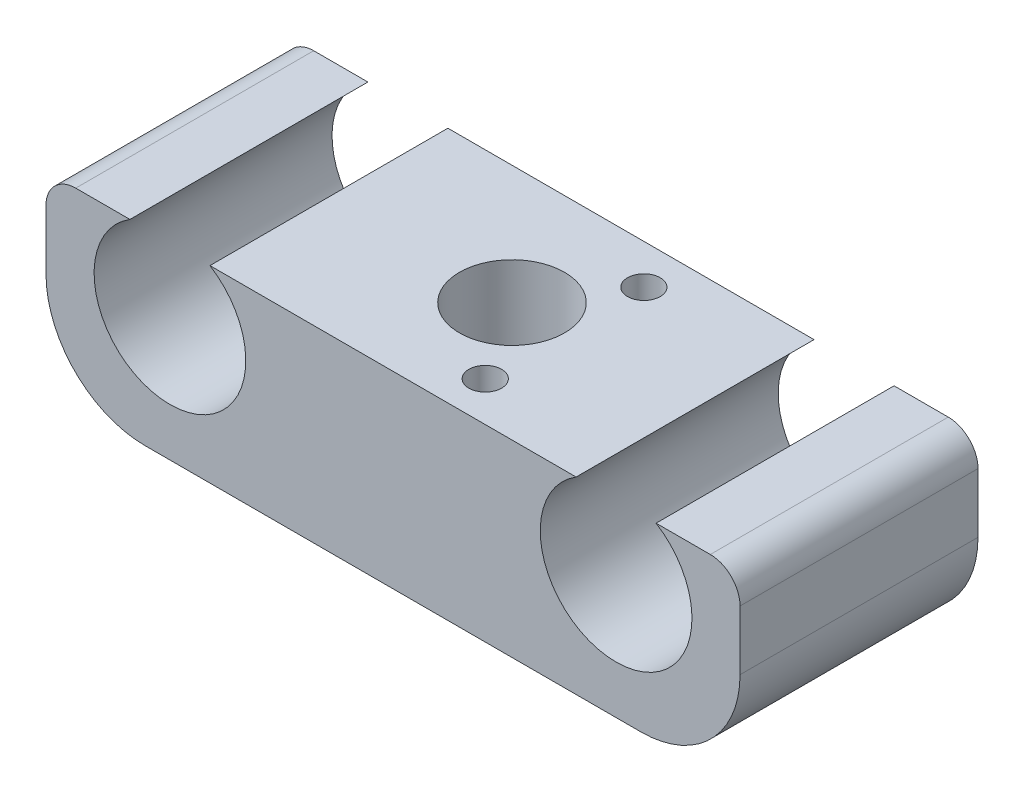
ISO-10303-21;
HEADER;
FILE_DESCRIPTION(('STEP AP214'),'2;1');
FILE_NAME('part.step','',(''),(''),'','','');
FILE_SCHEMA(('AUTOMOTIVE_DESIGN { 1 0 10303 214 1 1 1 1 }'));
ENDSEC;
DATA;
#1=APPLICATION_CONTEXT('core data for automotive mechanical design processes');
#2=APPLICATION_PROTOCOL_DEFINITION('international standard','automotive_design',2000,#1);
#3=PRODUCT_CONTEXT('',#1,'mechanical');
#4=PRODUCT('Part','Part','',(#3));
#5=PRODUCT_RELATED_PRODUCT_CATEGORY('part','',(#4));
#6=PRODUCT_DEFINITION_FORMATION('','',#4);
#7=PRODUCT_DEFINITION_CONTEXT('part definition',#1,'design');
#8=PRODUCT_DEFINITION('design','',#6,#7);
#9=PRODUCT_DEFINITION_SHAPE('','',#8);
#10=(LENGTH_UNIT() NAMED_UNIT(*) SI_UNIT(.MILLI.,.METRE.));
#11=(NAMED_UNIT(*) PLANE_ANGLE_UNIT() SI_UNIT($,.RADIAN.));
#12=(NAMED_UNIT(*) SI_UNIT($,.STERADIAN.) SOLID_ANGLE_UNIT());
#13=UNCERTAINTY_MEASURE_WITH_UNIT(LENGTH_MEASURE(1.E-05),#10,'distance_accuracy_value','');
#14=(GEOMETRIC_REPRESENTATION_CONTEXT(3) GLOBAL_UNCERTAINTY_ASSIGNED_CONTEXT((#13)) GLOBAL_UNIT_ASSIGNED_CONTEXT((#10,
#11,#12)) REPRESENTATION_CONTEXT('',''));
#15=CARTESIAN_POINT('',(0.,0.,0.));
#16=DIRECTION('',(0.,0.,1.));
#17=DIRECTION('',(1.,0.,0.));
#18=AXIS2_PLACEMENT_3D('',#15,#16,#17);
#19=CARTESIAN_POINT('',(0.,19.,24.));
#20=DIRECTION('',(0.,-1.,0.));
#21=DIRECTION('',(0.,0.,-1.));
#22=AXIS2_PLACEMENT_3D('',#19,#20,#21);
#23=PLANE('',#22);
#24=CARTESIAN_POINT('',(40.3,19.,4.));
#25=DIRECTION('',(0.,1.,0.));
#26=DIRECTION('',(0.,0.,1.));
#27=AXIS2_PLACEMENT_3D('',#24,#25,#26);
#28=CIRCLE('',#27,1.65);
#29=CARTESIAN_POINT('',(40.3,19.,5.65));
#30=VERTEX_POINT('',#29);
#31=EDGE_CURVE('E220',#30,#30,#28,.T.);
#32=ORIENTED_EDGE('',*,*,#31,.F.);
#33=EDGE_LOOP('',(#32));
#34=FACE_BOUND('',#33,.T.);
#35=CARTESIAN_POINT('',(40.3,19.,20.));
#36=DIRECTION('',(0.,1.,0.));
#37=DIRECTION('',(0.,0.,1.));
#38=AXIS2_PLACEMENT_3D('',#35,#36,#37);
#39=CIRCLE('',#38,1.65);
#40=CARTESIAN_POINT('',(40.3,19.,21.65));
#41=VERTEX_POINT('',#40);
#42=EDGE_CURVE('E209',#41,#41,#39,.T.);
#43=ORIENTED_EDGE('',*,*,#42,.F.);
#44=EDGE_LOOP('',(#43));
#45=FACE_BOUND('',#44,.T.);
#46=CARTESIAN_POINT('',(35.,19.,12.));
#47=DIRECTION('',(0.,-1.,0.));
#48=DIRECTION('',(0.,0.,-1.));
#49=AXIS2_PLACEMENT_3D('',#46,#47,#48);
#50=CIRCLE('',#49,5.3);
#51=CARTESIAN_POINT('',(35.,19.,6.7));
#52=VERTEX_POINT('',#51);
#53=EDGE_CURVE('E213',#52,#52,#50,.T.);
#54=ORIENTED_EDGE('',*,*,#53,.T.);
#55=EDGE_LOOP('',(#54));
#56=FACE_BOUND('',#55,.T.);
#57=DIRECTION('',(-1.,0.,0.));
#58=VECTOR('',#57,1.);
#59=CARTESIAN_POINT('',(0.,19.,0.));
#60=LINE('',#59,#58);
#61=CARTESIAN_POINT('',(53.466081309694,19.,0.));
#62=VERTEX_POINT('',#61);
#63=CARTESIAN_POINT('',(16.533918690306,19.,0.));
#64=VERTEX_POINT('',#63);
#65=EDGE_CURVE('E150',#62,#64,#60,.T.);
#66=ORIENTED_EDGE('',*,*,#65,.T.);
#67=DIRECTION('',(0.,0.,1.));
#68=VECTOR('',#67,1.);
#69=CARTESIAN_POINT('',(16.533918690306,19.,0.));
#70=LINE('',#69,#68);
#71=CARTESIAN_POINT('',(16.533918690306,19.,24.));
#72=VERTEX_POINT('',#71);
#73=EDGE_CURVE('E130',#64,#72,#70,.T.);
#74=ORIENTED_EDGE('',*,*,#73,.T.);
#75=DIRECTION('',(-1.,0.,0.));
#76=VECTOR('',#75,1.);
#77=CARTESIAN_POINT('',(0.,19.,24.));
#78=LINE('',#77,#76);
#79=CARTESIAN_POINT('',(53.466081309694,19.,24.));
#80=VERTEX_POINT('',#79);
#81=EDGE_CURVE('E177',#80,#72,#78,.T.);
#82=ORIENTED_EDGE('',*,*,#81,.F.);
#83=DIRECTION('',(0.,0.,1.));
#84=VECTOR('',#83,1.);
#85=CARTESIAN_POINT('',(53.466081309694,19.,0.));
#86=LINE('',#85,#84);
#87=EDGE_CURVE('E229',#80,#62,#86,.F.);
#88=ORIENTED_EDGE('',*,*,#87,.T.);
#89=EDGE_LOOP('',(#66,#74,#82,#88));
#90=FACE_BOUND('',#89,.T.);
#91=ADVANCED_FACE('F34',(#34,#45,#56,#90),#23,.F.);
#92=CARTESIAN_POINT('',(67.,19.,24.));
#93=VERTEX_POINT('',#92);
#94=CARTESIAN_POINT('',(61.533918690306,19.,24.));
#95=VERTEX_POINT('',#94);
#96=EDGE_CURVE('E175',#93,#95,#78,.T.);
#97=ORIENTED_EDGE('',*,*,#96,.F.);
#98=DIRECTION('',(0.,0.,-1.));
#99=VECTOR('',#98,1.);
#100=CARTESIAN_POINT('',(67.,19.,24.));
#101=LINE('',#100,#99);
#102=CARTESIAN_POINT('',(67.,19.,0.));
#103=VERTEX_POINT('',#102);
#104=EDGE_CURVE('E198',#93,#103,#101,.T.);
#105=ORIENTED_EDGE('',*,*,#104,.T.);
#106=CARTESIAN_POINT('',(61.533918690306,19.,0.));
#107=VERTEX_POINT('',#106);
#108=EDGE_CURVE('E153',#103,#107,#60,.T.);
#109=ORIENTED_EDGE('',*,*,#108,.T.);
#110=DIRECTION('',(0.,0.,1.));
#111=VECTOR('',#110,1.);
#112=CARTESIAN_POINT('',(61.533918690306,19.,0.));
#113=LINE('',#112,#111);
#114=EDGE_CURVE('E171',#107,#95,#113,.T.);
#115=ORIENTED_EDGE('',*,*,#114,.T.);
#116=EDGE_LOOP('',(#97,#105,#109,#115));
#117=FACE_BOUND('',#116,.T.);
#118=ADVANCED_FACE('F234',(#117),#23,.F.);
#119=CARTESIAN_POINT('',(0.,0.,24.));
#120=DIRECTION('',(1.,0.,0.));
#121=DIRECTION('',(0.,0.,-1.));
#122=AXIS2_PLACEMENT_3D('',#119,#120,#121);
#123=PLANE('',#122);
#124=DIRECTION('',(0.,-1.,0.));
#125=VECTOR('',#124,1.);
#126=CARTESIAN_POINT('',(0.,0.,24.));
#127=LINE('',#126,#125);
#128=CARTESIAN_POINT('',(0.,16.,24.));
#129=VERTEX_POINT('',#128);
#130=CARTESIAN_POINT('',(0.,10.,24.));
#131=VERTEX_POINT('',#130);
#132=EDGE_CURVE('E157',#129,#131,#127,.T.);
#133=ORIENTED_EDGE('',*,*,#132,.F.);
#134=DIRECTION('',(0.,0.,-1.));
#135=VECTOR('',#134,1.);
#136=CARTESIAN_POINT('',(0.,16.,24.));
#137=LINE('',#136,#135);
#138=CARTESIAN_POINT('',(0.,16.,0.));
#139=VERTEX_POINT('',#138);
#140=EDGE_CURVE('E248',#129,#139,#137,.T.);
#141=ORIENTED_EDGE('',*,*,#140,.T.);
#142=DIRECTION('',(0.,-1.,0.));
#143=VECTOR('',#142,1.);
#144=CARTESIAN_POINT('',(0.,0.,0.));
#145=LINE('',#144,#143);
#146=CARTESIAN_POINT('',(0.,10.,0.));
#147=VERTEX_POINT('',#146);
#148=EDGE_CURVE('E178',#139,#147,#145,.T.);
#149=ORIENTED_EDGE('',*,*,#148,.T.);
#150=DIRECTION('',(0.,0.,-1.));
#151=VECTOR('',#150,1.);
#152=CARTESIAN_POINT('',(0.,10.,24.));
#153=LINE('',#152,#151);
#154=EDGE_CURVE('E244',#147,#131,#153,.F.);
#155=ORIENTED_EDGE('',*,*,#154,.T.);
#156=EDGE_LOOP('',(#133,#141,#149,#155));
#157=FACE_BOUND('',#156,.T.);
#158=ADVANCED_FACE('F274',(#157),#123,.F.);
#159=CARTESIAN_POINT('',(0.,0.,24.));
#160=DIRECTION('',(0.,1.,0.));
#161=DIRECTION('',(0.,0.,1.));
#162=AXIS2_PLACEMENT_3D('',#159,#160,#161);
#163=PLANE('',#162);
#164=CARTESIAN_POINT('',(40.3,0.,4.));
#165=DIRECTION('',(0.,1.,0.));
#166=DIRECTION('',(0.,0.,1.));
#167=AXIS2_PLACEMENT_3D('',#164,#165,#166);
#168=CIRCLE('',#167,1.65);
#169=CARTESIAN_POINT('',(40.3,0.,5.65));
#170=VERTEX_POINT('',#169);
#171=EDGE_CURVE('E38',#170,#170,#168,.T.);
#172=ORIENTED_EDGE('',*,*,#171,.T.);
#173=EDGE_LOOP('',(#172));
#174=FACE_BOUND('',#173,.T.);
#175=CARTESIAN_POINT('',(40.3,0.,20.));
#176=DIRECTION('',(0.,1.,0.));
#177=DIRECTION('',(0.,0.,1.));
#178=AXIS2_PLACEMENT_3D('',#175,#176,#177);
#179=CIRCLE('',#178,1.65);
#180=CARTESIAN_POINT('',(40.3,0.,21.65));
#181=VERTEX_POINT('',#180);
#182=EDGE_CURVE('E206',#181,#181,#179,.T.);
#183=ORIENTED_EDGE('',*,*,#182,.T.);
#184=EDGE_LOOP('',(#183));
#185=FACE_BOUND('',#184,.T.);
#186=CARTESIAN_POINT('',(35.,0.,12.));
#187=DIRECTION('',(0.,-1.,0.));
#188=DIRECTION('',(0.,0.,-1.));
#189=AXIS2_PLACEMENT_3D('',#186,#187,#188);
#190=CIRCLE('',#189,5.3);
#191=CARTESIAN_POINT('',(35.,0.,6.7));
#192=VERTEX_POINT('',#191);
#193=EDGE_CURVE('E208',#192,#192,#190,.T.);
#194=ORIENTED_EDGE('',*,*,#193,.F.);
#195=EDGE_LOOP('',(#194));
#196=FACE_BOUND('',#195,.T.);
#197=DIRECTION('',(1.,0.,0.));
#198=VECTOR('',#197,1.);
#199=CARTESIAN_POINT('',(0.,0.,0.));
#200=LINE('',#199,#198);
#201=CARTESIAN_POINT('',(10.,0.,0.));
#202=VERTEX_POINT('',#201);
#203=CARTESIAN_POINT('',(60.,0.,0.));
#204=VERTEX_POINT('',#203);
#205=EDGE_CURVE('E154',#202,#204,#200,.T.);
#206=ORIENTED_EDGE('',*,*,#205,.T.);
#207=DIRECTION('',(0.,0.,-1.));
#208=VECTOR('',#207,1.);
#209=CARTESIAN_POINT('',(60.,0.,24.));
#210=LINE('',#209,#208);
#211=CARTESIAN_POINT('',(60.,0.,24.));
#212=VERTEX_POINT('',#211);
#213=EDGE_CURVE('E187',#204,#212,#210,.F.);
#214=ORIENTED_EDGE('',*,*,#213,.T.);
#215=DIRECTION('',(1.,0.,0.));
#216=VECTOR('',#215,1.);
#217=CARTESIAN_POINT('',(0.,0.,24.));
#218=LINE('',#217,#216);
#219=CARTESIAN_POINT('',(10.,0.,24.));
#220=VERTEX_POINT('',#219);
#221=EDGE_CURVE('E162',#220,#212,#218,.T.);
#222=ORIENTED_EDGE('',*,*,#221,.F.);
#223=DIRECTION('',(0.,0.,-1.));
#224=VECTOR('',#223,1.);
#225=CARTESIAN_POINT('',(10.,0.,24.));
#226=LINE('',#225,#224);
#227=EDGE_CURVE('E134',#220,#202,#226,.T.);
#228=ORIENTED_EDGE('',*,*,#227,.T.);
#229=EDGE_LOOP('',(#206,#214,#222,#228));
#230=FACE_BOUND('',#229,.T.);
#231=ADVANCED_FACE('F185',(#174,#185,#196,#230),#163,.F.);
#232=CARTESIAN_POINT('',(70.,19.,24.));
#233=DIRECTION('',(-1.,0.,0.));
#234=DIRECTION('',(0.,0.,1.));
#235=AXIS2_PLACEMENT_3D('',#232,#233,#234);
#236=PLANE('',#235);
#237=DIRECTION('',(0.,1.,0.));
#238=VECTOR('',#237,1.);
#239=CARTESIAN_POINT('',(70.,19.,0.));
#240=LINE('',#239,#238);
#241=CARTESIAN_POINT('',(70.,10.,0.));
#242=VERTEX_POINT('',#241);
#243=CARTESIAN_POINT('',(70.,16.,0.));
#244=VERTEX_POINT('',#243);
#245=EDGE_CURVE('E151',#242,#244,#240,.T.);
#246=ORIENTED_EDGE('',*,*,#245,.T.);
#247=DIRECTION('',(0.,0.,-1.));
#248=VECTOR('',#247,1.);
#249=CARTESIAN_POINT('',(70.,16.,24.));
#250=LINE('',#249,#248);
#251=CARTESIAN_POINT('',(70.,16.,24.));
#252=VERTEX_POINT('',#251);
#253=EDGE_CURVE('E43',#244,#252,#250,.F.);
#254=ORIENTED_EDGE('',*,*,#253,.T.);
#255=DIRECTION('',(0.,1.,0.));
#256=VECTOR('',#255,1.);
#257=CARTESIAN_POINT('',(70.,19.,24.));
#258=LINE('',#257,#256);
#259=CARTESIAN_POINT('',(70.,10.,24.));
#260=VERTEX_POINT('',#259);
#261=EDGE_CURVE('E168',#260,#252,#258,.T.);
#262=ORIENTED_EDGE('',*,*,#261,.F.);
#263=DIRECTION('',(0.,0.,-1.));
#264=VECTOR('',#263,1.);
#265=CARTESIAN_POINT('',(70.,10.,24.));
#266=LINE('',#265,#264);
#267=EDGE_CURVE('E200',#260,#242,#266,.T.);
#268=ORIENTED_EDGE('',*,*,#267,.T.);
#269=EDGE_LOOP('',(#246,#254,#262,#268));
#270=FACE_BOUND('',#269,.T.);
#271=ADVANCED_FACE('F255',(#270),#236,.F.);
#272=CARTESIAN_POINT('',(8.46608130969402,19.,0.));
#273=VERTEX_POINT('',#272);
#274=CARTESIAN_POINT('',(3.,19.,0.));
#275=VERTEX_POINT('',#274);
#276=EDGE_CURVE('E141',#273,#275,#60,.T.);
#277=ORIENTED_EDGE('',*,*,#276,.T.);
#278=DIRECTION('',(0.,0.,-1.));
#279=VECTOR('',#278,1.);
#280=CARTESIAN_POINT('',(3.,19.,24.));
#281=LINE('',#280,#279);
#282=CARTESIAN_POINT('',(3.,19.,24.));
#283=VERTEX_POINT('',#282);
#284=EDGE_CURVE('E252',#275,#283,#281,.F.);
#285=ORIENTED_EDGE('',*,*,#284,.T.);
#286=CARTESIAN_POINT('',(8.46608130969402,19.,24.));
#287=VERTEX_POINT('',#286);
#288=EDGE_CURVE('E144',#287,#283,#78,.T.);
#289=ORIENTED_EDGE('',*,*,#288,.F.);
#290=DIRECTION('',(0.,0.,1.));
#291=VECTOR('',#290,1.);
#292=CARTESIAN_POINT('',(8.46608130969402,19.,0.));
#293=LINE('',#292,#291);
#294=EDGE_CURVE('E127',#287,#273,#293,.F.);
#295=ORIENTED_EDGE('',*,*,#294,.T.);
#296=EDGE_LOOP('',(#277,#285,#289,#295));
#297=FACE_BOUND('',#296,.T.);
#298=ADVANCED_FACE('F140',(#297),#23,.F.);
#299=CARTESIAN_POINT('',(0.,0.,24.));
#300=DIRECTION('',(0.,0.,-1.));
#301=DIRECTION('',(-1.,0.,0.));
#302=AXIS2_PLACEMENT_3D('',#299,#300,#301);
#303=PLANE('',#302);
#304=ORIENTED_EDGE('',*,*,#261,.T.);
#305=CARTESIAN_POINT('',(67.,16.,24.));
#306=DIRECTION('',(0.,0.,-1.));
#307=DIRECTION('',(-1.,0.,0.));
#308=AXIS2_PLACEMENT_3D('',#305,#306,#307);
#309=CIRCLE('',#308,3.);
#310=EDGE_CURVE('E11',#252,#93,#309,.F.);
#311=ORIENTED_EDGE('',*,*,#310,.T.);
#312=ORIENTED_EDGE('',*,*,#96,.T.);
#313=CARTESIAN_POINT('',(57.5,12.5,24.));
#314=DIRECTION('',(0.,0.,1.));
#315=DIRECTION('',(1.,0.,0.));
#316=AXIS2_PLACEMENT_3D('',#313,#314,#315);
#317=CIRCLE('',#316,7.65);
#318=EDGE_CURVE('E227',#80,#95,#317,.T.);
#319=ORIENTED_EDGE('',*,*,#318,.F.);
#320=ORIENTED_EDGE('',*,*,#81,.T.);
#321=CARTESIAN_POINT('',(12.5,12.5,24.));
#322=DIRECTION('',(0.,0.,1.));
#323=DIRECTION('',(1.,0.,0.));
#324=AXIS2_PLACEMENT_3D('',#321,#322,#323);
#325=CIRCLE('',#324,7.65);
#326=EDGE_CURVE('E145',#287,#72,#325,.T.);
#327=ORIENTED_EDGE('',*,*,#326,.F.);
#328=ORIENTED_EDGE('',*,*,#288,.T.);
#329=CARTESIAN_POINT('',(3.,16.,24.));
#330=DIRECTION('',(0.,0.,-1.));
#331=DIRECTION('',(-1.,0.,0.));
#332=AXIS2_PLACEMENT_3D('',#329,#330,#331);
#333=CIRCLE('',#332,3.);
#334=EDGE_CURVE('E254',#283,#129,#333,.F.);
#335=ORIENTED_EDGE('',*,*,#334,.T.);
#336=ORIENTED_EDGE('',*,*,#132,.T.);
#337=CARTESIAN_POINT('',(10.,10.,24.));
#338=DIRECTION('',(0.,0.,-1.));
#339=DIRECTION('',(-1.,0.,0.));
#340=AXIS2_PLACEMENT_3D('',#337,#338,#339);
#341=CIRCLE('',#340,10.);
#342=EDGE_CURVE('E246',#131,#220,#341,.F.);
#343=ORIENTED_EDGE('',*,*,#342,.T.);
#344=ORIENTED_EDGE('',*,*,#221,.T.);
#345=CARTESIAN_POINT('',(60.,10.,24.));
#346=DIRECTION('',(0.,0.,-1.));
#347=DIRECTION('',(-1.,0.,0.));
#348=AXIS2_PLACEMENT_3D('',#345,#346,#347);
#349=CIRCLE('',#348,10.);
#350=EDGE_CURVE('E196',#212,#260,#349,.F.);
#351=ORIENTED_EDGE('',*,*,#350,.T.);
#352=EDGE_LOOP('',(#304,#311,#312,#319,#320,#327,#328,#335,#336,#343,#344,#351));
#353=FACE_BOUND('',#352,.T.);
#354=ADVANCED_FACE('F257',(#353),#303,.F.);
#355=CARTESIAN_POINT('',(0.,0.,0.));
#356=DIRECTION('',(0.,0.,-1.));
#357=DIRECTION('',(-1.,0.,0.));
#358=AXIS2_PLACEMENT_3D('',#355,#356,#357);
#359=PLANE('',#358);
#360=ORIENTED_EDGE('',*,*,#108,.F.);
#361=CARTESIAN_POINT('',(67.,16.,0.));
#362=DIRECTION('',(0.,0.,-1.));
#363=DIRECTION('',(-1.,0.,0.));
#364=AXIS2_PLACEMENT_3D('',#361,#362,#363);
#365=CIRCLE('',#364,3.);
#366=EDGE_CURVE('E58',#103,#244,#365,.T.);
#367=ORIENTED_EDGE('',*,*,#366,.T.);
#368=ORIENTED_EDGE('',*,*,#245,.F.);
#369=CARTESIAN_POINT('',(60.,10.,0.));
#370=DIRECTION('',(0.,0.,-1.));
#371=DIRECTION('',(-1.,0.,0.));
#372=AXIS2_PLACEMENT_3D('',#369,#370,#371);
#373=CIRCLE('',#372,10.);
#374=EDGE_CURVE('E194',#242,#204,#373,.T.);
#375=ORIENTED_EDGE('',*,*,#374,.T.);
#376=ORIENTED_EDGE('',*,*,#205,.F.);
#377=CARTESIAN_POINT('',(10.,10.,0.));
#378=DIRECTION('',(0.,0.,-1.));
#379=DIRECTION('',(-1.,0.,0.));
#380=AXIS2_PLACEMENT_3D('',#377,#378,#379);
#381=CIRCLE('',#380,10.);
#382=EDGE_CURVE('E242',#202,#147,#381,.T.);
#383=ORIENTED_EDGE('',*,*,#382,.T.);
#384=ORIENTED_EDGE('',*,*,#148,.F.);
#385=CARTESIAN_POINT('',(3.,16.,0.));
#386=DIRECTION('',(0.,0.,-1.));
#387=DIRECTION('',(-1.,0.,0.));
#388=AXIS2_PLACEMENT_3D('',#385,#386,#387);
#389=CIRCLE('',#388,3.);
#390=EDGE_CURVE('E149',#139,#275,#389,.T.);
#391=ORIENTED_EDGE('',*,*,#390,.T.);
#392=ORIENTED_EDGE('',*,*,#276,.F.);
#393=CARTESIAN_POINT('',(12.5,12.5,0.));
#394=DIRECTION('',(0.,0.,-1.));
#395=DIRECTION('',(-1.,0.,0.));
#396=AXIS2_PLACEMENT_3D('',#393,#394,#395);
#397=CIRCLE('',#396,7.65);
#398=EDGE_CURVE('E124',#64,#273,#397,.T.);
#399=ORIENTED_EDGE('',*,*,#398,.F.);
#400=ORIENTED_EDGE('',*,*,#65,.F.);
#401=CARTESIAN_POINT('',(57.5,12.5,0.));
#402=DIRECTION('',(0.,0.,-1.));
#403=DIRECTION('',(-1.,0.,0.));
#404=AXIS2_PLACEMENT_3D('',#401,#402,#403);
#405=CIRCLE('',#404,7.65);
#406=EDGE_CURVE('E135',#107,#62,#405,.T.);
#407=ORIENTED_EDGE('',*,*,#406,.F.);
#408=EDGE_LOOP('',(#360,#367,#368,#375,#376,#383,#384,#391,#392,#399,#400,#407));
#409=FACE_BOUND('',#408,.T.);
#410=ADVANCED_FACE('F147',(#409),#359,.T.);
#411=CARTESIAN_POINT('',(57.5,12.5,0.));
#412=DIRECTION('',(0.,0.,1.));
#413=DIRECTION('',(1.,0.,0.));
#414=AXIS2_PLACEMENT_3D('',#411,#412,#413);
#415=CYLINDRICAL_SURFACE('',#414,7.65);
#416=ORIENTED_EDGE('',*,*,#406,.T.);
#417=ORIENTED_EDGE('',*,*,#87,.F.);
#418=ORIENTED_EDGE('',*,*,#318,.T.);
#419=ORIENTED_EDGE('',*,*,#114,.F.);
#420=EDGE_LOOP('',(#416,#417,#418,#419));
#421=FACE_BOUND('',#420,.T.);
#422=ADVANCED_FACE('F238',(#421),#415,.F.);
#423=CARTESIAN_POINT('',(12.5,12.5,0.));
#424=DIRECTION('',(0.,0.,1.));
#425=DIRECTION('',(1.,0.,0.));
#426=AXIS2_PLACEMENT_3D('',#423,#424,#425);
#427=CYLINDRICAL_SURFACE('',#426,7.65);
#428=ORIENTED_EDGE('',*,*,#398,.T.);
#429=ORIENTED_EDGE('',*,*,#294,.F.);
#430=ORIENTED_EDGE('',*,*,#326,.T.);
#431=ORIENTED_EDGE('',*,*,#73,.F.);
#432=EDGE_LOOP('',(#428,#429,#430,#431));
#433=FACE_BOUND('',#432,.T.);
#434=ADVANCED_FACE('F126',(#433),#427,.F.);
#435=CARTESIAN_POINT('',(35.,24.,12.));
#436=DIRECTION('',(0.,-1.,0.));
#437=DIRECTION('',(0.,0.,-1.));
#438=AXIS2_PLACEMENT_3D('',#435,#436,#437);
#439=CYLINDRICAL_SURFACE('',#438,5.3);
#440=ORIENTED_EDGE('',*,*,#193,.T.);
#441=EDGE_LOOP('',(#440));
#442=FACE_BOUND('',#441,.T.);
#443=ORIENTED_EDGE('',*,*,#53,.F.);
#444=EDGE_LOOP('',(#443));
#445=FACE_BOUND('',#444,.T.);
#446=ADVANCED_FACE('F297',(#442,#445),#439,.F.);
#447=CARTESIAN_POINT('',(10.,10.,24.));
#448=DIRECTION('',(0.,0.,-1.));
#449=DIRECTION('',(-1.,0.,0.));
#450=AXIS2_PLACEMENT_3D('',#447,#448,#449);
#451=CYLINDRICAL_SURFACE('',#450,10.);
#452=ORIENTED_EDGE('',*,*,#342,.F.);
#453=ORIENTED_EDGE('',*,*,#154,.F.);
#454=ORIENTED_EDGE('',*,*,#382,.F.);
#455=ORIENTED_EDGE('',*,*,#227,.F.);
#456=EDGE_LOOP('',(#452,#453,#454,#455));
#457=FACE_BOUND('',#456,.T.);
#458=ADVANCED_FACE('F294',(#457),#451,.T.);
#459=CARTESIAN_POINT('',(3.,16.,24.));
#460=DIRECTION('',(0.,0.,-1.));
#461=DIRECTION('',(-1.,0.,0.));
#462=AXIS2_PLACEMENT_3D('',#459,#460,#461);
#463=CYLINDRICAL_SURFACE('',#462,3.);
#464=ORIENTED_EDGE('',*,*,#334,.F.);
#465=ORIENTED_EDGE('',*,*,#284,.F.);
#466=ORIENTED_EDGE('',*,*,#390,.F.);
#467=ORIENTED_EDGE('',*,*,#140,.F.);
#468=EDGE_LOOP('',(#464,#465,#466,#467));
#469=FACE_BOUND('',#468,.T.);
#470=ADVANCED_FACE('F267',(#469),#463,.T.);
#471=CARTESIAN_POINT('',(60.,10.,24.));
#472=DIRECTION('',(0.,0.,-1.));
#473=DIRECTION('',(-1.,0.,0.));
#474=AXIS2_PLACEMENT_3D('',#471,#472,#473);
#475=CYLINDRICAL_SURFACE('',#474,10.);
#476=ORIENTED_EDGE('',*,*,#350,.F.);
#477=ORIENTED_EDGE('',*,*,#213,.F.);
#478=ORIENTED_EDGE('',*,*,#374,.F.);
#479=ORIENTED_EDGE('',*,*,#267,.F.);
#480=EDGE_LOOP('',(#476,#477,#478,#479));
#481=FACE_BOUND('',#480,.T.);
#482=ADVANCED_FACE('F192',(#481),#475,.T.);
#483=CARTESIAN_POINT('',(67.,16.,24.));
#484=DIRECTION('',(0.,0.,-1.));
#485=DIRECTION('',(-1.,0.,0.));
#486=AXIS2_PLACEMENT_3D('',#483,#484,#485);
#487=CYLINDRICAL_SURFACE('',#486,3.);
#488=ORIENTED_EDGE('',*,*,#310,.F.);
#489=ORIENTED_EDGE('',*,*,#253,.F.);
#490=ORIENTED_EDGE('',*,*,#366,.F.);
#491=ORIENTED_EDGE('',*,*,#104,.F.);
#492=EDGE_LOOP('',(#488,#489,#490,#491));
#493=FACE_BOUND('',#492,.T.);
#494=ADVANCED_FACE('F36',(#493),#487,.T.);
#495=CARTESIAN_POINT('',(40.3,-5.,20.));
#496=DIRECTION('',(0.,1.,0.));
#497=DIRECTION('',(0.,0.,1.));
#498=AXIS2_PLACEMENT_3D('',#495,#496,#497);
#499=CYLINDRICAL_SURFACE('',#498,1.65);
#500=ORIENTED_EDGE('',*,*,#42,.T.);
#501=EDGE_LOOP('',(#500));
#502=FACE_BOUND('',#501,.T.);
#503=ORIENTED_EDGE('',*,*,#182,.F.);
#504=EDGE_LOOP('',(#503));
#505=FACE_BOUND('',#504,.T.);
#506=ADVANCED_FACE('F260',(#502,#505),#499,.F.);
#507=CARTESIAN_POINT('',(40.3,-5.,4.));
#508=DIRECTION('',(0.,1.,0.));
#509=DIRECTION('',(0.,0.,1.));
#510=AXIS2_PLACEMENT_3D('',#507,#508,#509);
#511=CYLINDRICAL_SURFACE('',#510,1.65);
#512=ORIENTED_EDGE('',*,*,#31,.T.);
#513=EDGE_LOOP('',(#512));
#514=FACE_BOUND('',#513,.T.);
#515=ORIENTED_EDGE('',*,*,#171,.F.);
#516=EDGE_LOOP('',(#515));
#517=FACE_BOUND('',#516,.T.);
#518=ADVANCED_FACE('F265',(#514,#517),#511,.F.);
#519=CLOSED_SHELL('',(#91,#118,#158,#231,#271,#298,#354,#410,#422,#434,#446,#458,#470,#482,#494,
#506,#518));
#520=MANIFOLD_SOLID_BREP('B2',#519);
#521=ADVANCED_BREP_SHAPE_REPRESENTATION('',(#18,#520),#14);
#522=SHAPE_DEFINITION_REPRESENTATION(#9,#521);
ENDSEC;
END-ISO-10303-21;
